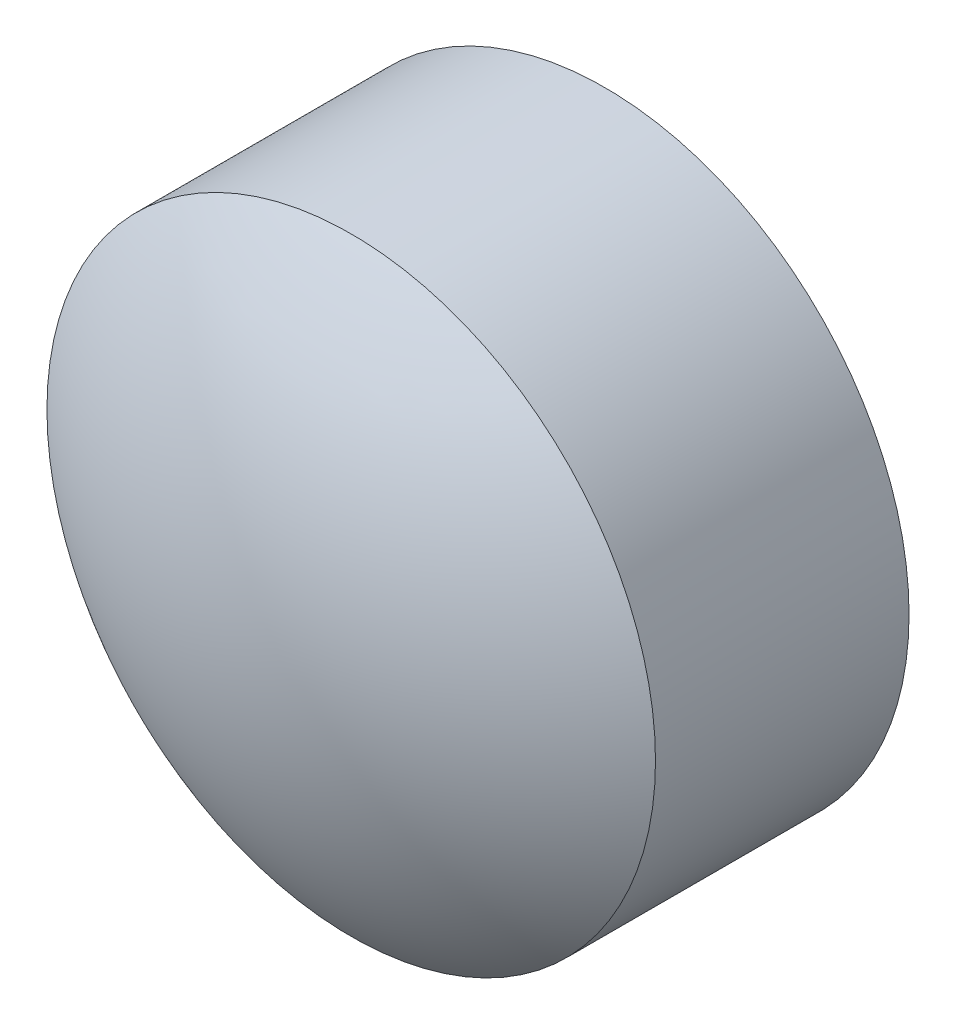
ISO-10303-21;
HEADER;
FILE_DESCRIPTION(('STEP AP214'),'2;1');
FILE_NAME('part.step','',(''),(''),'','','');
FILE_SCHEMA(('AUTOMOTIVE_DESIGN { 1 0 10303 214 1 1 1 1 }'));
ENDSEC;
DATA;
#1=APPLICATION_CONTEXT('core data for automotive mechanical design processes');
#2=APPLICATION_PROTOCOL_DEFINITION('international standard','automotive_design',2000,#1);
#3=PRODUCT_CONTEXT('',#1,'mechanical');
#4=PRODUCT('Part','Part','',(#3));
#5=PRODUCT_RELATED_PRODUCT_CATEGORY('part','',(#4));
#6=PRODUCT_DEFINITION_FORMATION('','',#4);
#7=PRODUCT_DEFINITION_CONTEXT('part definition',#1,'design');
#8=PRODUCT_DEFINITION('design','',#6,#7);
#9=PRODUCT_DEFINITION_SHAPE('','',#8);
#10=(LENGTH_UNIT() NAMED_UNIT(*) SI_UNIT(.MILLI.,.METRE.));
#11=(NAMED_UNIT(*) PLANE_ANGLE_UNIT() SI_UNIT($,.RADIAN.));
#12=(NAMED_UNIT(*) SI_UNIT($,.STERADIAN.) SOLID_ANGLE_UNIT());
#13=UNCERTAINTY_MEASURE_WITH_UNIT(LENGTH_MEASURE(1.E-05),#10,'distance_accuracy_value','');
#14=(GEOMETRIC_REPRESENTATION_CONTEXT(3) GLOBAL_UNCERTAINTY_ASSIGNED_CONTEXT((#13)) GLOBAL_UNIT_ASSIGNED_CONTEXT((#10,
#11,#12)) REPRESENTATION_CONTEXT('',''));
#15=CARTESIAN_POINT('',(0.,0.,0.));
#16=DIRECTION('',(0.,0.,1.));
#17=DIRECTION('',(1.,0.,0.));
#18=AXIS2_PLACEMENT_3D('',#15,#16,#17);
#19=CARTESIAN_POINT('',(0.,0.,5.));
#20=DIRECTION('',(0.,0.,-1.));
#21=DIRECTION('',(-1.,0.,0.));
#22=AXIS2_PLACEMENT_3D('',#19,#20,#21);
#23=CYLINDRICAL_SURFACE('',#22,6.);
#24=CARTESIAN_POINT('',(0.,0.,5.));
#25=DIRECTION('',(0.,0.,1.));
#26=DIRECTION('',(1.,0.,0.));
#27=AXIS2_PLACEMENT_3D('',#24,#25,#26);
#28=CIRCLE('',#27,6.);
#29=CARTESIAN_POINT('',(6.,0.,5.));
#30=VERTEX_POINT('',#29);
#31=EDGE_CURVE('E10',#30,#30,#28,.T.);
#32=ORIENTED_EDGE('',*,*,#31,.F.);
#33=EDGE_LOOP('',(#32));
#34=FACE_BOUND('',#33,.T.);
#35=CARTESIAN_POINT('',(0.,0.,0.));
#36=DIRECTION('',(0.,0.,1.));
#37=DIRECTION('',(1.,0.,0.));
#38=AXIS2_PLACEMENT_3D('',#35,#36,#37);
#39=CIRCLE('',#38,6.);
#40=CARTESIAN_POINT('',(6.,0.,0.));
#41=VERTEX_POINT('',#40);
#42=EDGE_CURVE('E44',#41,#41,#39,.T.);
#43=ORIENTED_EDGE('',*,*,#42,.T.);
#44=EDGE_LOOP('',(#43));
#45=FACE_BOUND('',#44,.T.);
#46=ADVANCED_FACE('F36',(#34,#45),#23,.T.);
#47=CARTESIAN_POINT('',(0.,0.,-3.));
#48=DIRECTION('',(0.,0.,1.));
#49=DIRECTION('',(1.,0.,0.));
#50=AXIS2_PLACEMENT_3D('',#47,#48,#49);
#51=SPHERICAL_SURFACE('',#50,10.);
#52=ORIENTED_EDGE('',*,*,#31,.T.);
#53=EDGE_LOOP('',(#52));
#54=FACE_BOUND('',#53,.T.);
#55=ADVANCED_FACE('F38',(#54),#51,.T.);
#56=CARTESIAN_POINT('',(0.,0.,0.));
#57=DIRECTION('',(0.,0.,1.));
#58=DIRECTION('',(1.,0.,0.));
#59=AXIS2_PLACEMENT_3D('',#56,#57,#58);
#60=PLANE('',#59);
#61=ORIENTED_EDGE('',*,*,#42,.F.);
#62=EDGE_LOOP('',(#61));
#63=FACE_BOUND('',#62,.T.);
#64=ADVANCED_FACE('F52',(#63),#60,.F.);
#65=CLOSED_SHELL('',(#46,#55,#64));
#66=MANIFOLD_SOLID_BREP('B2',#65);
#67=ADVANCED_BREP_SHAPE_REPRESENTATION('',(#18,#66),#14);
#68=SHAPE_DEFINITION_REPRESENTATION(#9,#67);
ENDSEC;
END-ISO-10303-21;
